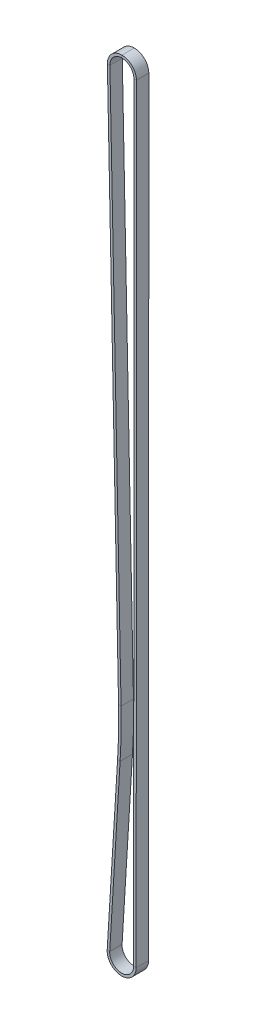
ISO-10303-21;
HEADER;
FILE_DESCRIPTION(('STEP AP214'),'2;1');
FILE_NAME('part.step','',(''),(''),'','','');
FILE_SCHEMA(('AUTOMOTIVE_DESIGN { 1 0 10303 214 1 1 1 1 }'));
ENDSEC;
DATA;
#1=APPLICATION_CONTEXT('core data for automotive mechanical design processes');
#2=APPLICATION_PROTOCOL_DEFINITION('international standard','automotive_design',2000,#1);
#3=PRODUCT_CONTEXT('',#1,'mechanical');
#4=PRODUCT('Part','Part','',(#3));
#5=PRODUCT_RELATED_PRODUCT_CATEGORY('part','',(#4));
#6=PRODUCT_DEFINITION_FORMATION('','',#4);
#7=PRODUCT_DEFINITION_CONTEXT('part definition',#1,'design');
#8=PRODUCT_DEFINITION('design','',#6,#7);
#9=PRODUCT_DEFINITION_SHAPE('','',#8);
#10=(LENGTH_UNIT() NAMED_UNIT(*) SI_UNIT(.MILLI.,.METRE.));
#11=(NAMED_UNIT(*) PLANE_ANGLE_UNIT() SI_UNIT($,.RADIAN.));
#12=(NAMED_UNIT(*) SI_UNIT($,.STERADIAN.) SOLID_ANGLE_UNIT());
#13=UNCERTAINTY_MEASURE_WITH_UNIT(LENGTH_MEASURE(1.E-05),#10,'distance_accuracy_value','');
#14=(GEOMETRIC_REPRESENTATION_CONTEXT(3) GLOBAL_UNCERTAINTY_ASSIGNED_CONTEXT((#13)) GLOBAL_UNIT_ASSIGNED_CONTEXT((#10,
#11,#12)) REPRESENTATION_CONTEXT('',''));
#15=CARTESIAN_POINT('',(0.,0.,0.));
#16=DIRECTION('',(0.,0.,1.));
#17=DIRECTION('',(1.,0.,0.));
#18=AXIS2_PLACEMENT_3D('',#15,#16,#17);
#19=CARTESIAN_POINT('',(0.,0.,0.));
#20=DIRECTION('',(0.,0.,-1.));
#21=DIRECTION('',(-1.,0.,0.));
#22=AXIS2_PLACEMENT_3D('',#19,#20,#21);
#23=CYLINDRICAL_SURFACE('',#22,8.63709969141602);
#24=CARTESIAN_POINT('',(0.,0.,-7.366));
#25=DIRECTION('',(0.,0.,-1.));
#26=DIRECTION('',(-0.999793518372617,-0.0203204483243957,0.));
#27=AXIS2_PLACEMENT_3D('',#24,#25,#26);
#28=CIRCLE('',#27,8.63709969141602);
#29=CARTESIAN_POINT('',(-8.63531628901586,-0.175509737952051,-7.366));
#30=VERTEX_POINT('',#29);
#31=CARTESIAN_POINT('',(0.,8.63709969141602,-7.366));
#32=VERTEX_POINT('',#31);
#33=EDGE_CURVE('E11',#30,#32,#28,.T.);
#34=ORIENTED_EDGE('',*,*,#33,.F.);
#35=DIRECTION('',(0.,0.,1.));
#36=VECTOR('',#35,1.);
#37=CARTESIAN_POINT('',(-8.63531628901586,-0.175509737952078,0.));
#38=LINE('',#37,#36);
#39=CARTESIAN_POINT('',(-8.63531628901586,-0.175509737952051,0.));
#40=VERTEX_POINT('',#39);
#41=EDGE_CURVE('E36',#30,#40,#38,.T.);
#42=ORIENTED_EDGE('',*,*,#41,.T.);
#43=CARTESIAN_POINT('',(0.,0.,0.));
#44=DIRECTION('',(0.,0.,-1.));
#45=DIRECTION('',(-0.999793518372617,-0.0203204483243957,0.));
#46=AXIS2_PLACEMENT_3D('',#43,#44,#45);
#47=CIRCLE('',#46,8.63709969141602);
#48=CARTESIAN_POINT('',(0.,8.63709969141602,0.));
#49=VERTEX_POINT('',#48);
#50=EDGE_CURVE('E157',#40,#49,#47,.T.);
#51=ORIENTED_EDGE('',*,*,#50,.T.);
#52=DIRECTION('',(0.,0.,1.));
#53=VECTOR('',#52,1.);
#54=CARTESIAN_POINT('',(0.,8.63709969141602,0.));
#55=LINE('',#54,#53);
#56=EDGE_CURVE('E160',#32,#49,#55,.T.);
#57=ORIENTED_EDGE('',*,*,#56,.F.);
#58=EDGE_LOOP('',(#34,#42,#51,#57));
#59=FACE_BOUND('',#58,.T.);
#60=ADVANCED_FACE('F33',(#59),#23,.T.);
#61=CARTESIAN_POINT('',(-8.63531628901586,-0.175509737952073,-7.366));
#62=DIRECTION('',(0.,0.,-1.));
#63=DIRECTION('',(-1.,0.,0.));
#64=AXIS2_PLACEMENT_3D('',#61,#62,#63);
#65=PLANE('',#64);
#66=CARTESIAN_POINT('',(0.,0.,-7.366));
#67=DIRECTION('',(0.,0.,-1.));
#68=DIRECTION('',(-0.999793518372617,-0.0203204483243957,0.));
#69=AXIS2_PLACEMENT_3D('',#66,#67,#68);
#70=CIRCLE('',#69,7.13709969141602);
#71=CARTESIAN_POINT('',(-7.13562601145693,-0.145029065465485,-7.366));
#72=VERTEX_POINT('',#71);
#73=CARTESIAN_POINT('',(0.,7.13709969141602,-7.366));
#74=VERTEX_POINT('',#73);
#75=EDGE_CURVE('E41',#72,#74,#70,.T.);
#76=ORIENTED_EDGE('',*,*,#75,.F.);
#77=DIRECTION('',(-0.999793518372617,-0.0203204483243962,0.));
#78=VECTOR('',#77,1.);
#79=CARTESIAN_POINT('',(-8.63531628901586,-0.175509737952078,-7.366));
#80=LINE('',#79,#78);
#81=EDGE_CURVE('E276',#72,#30,#80,.T.);
#82=ORIENTED_EDGE('',*,*,#81,.T.);
#83=ORIENTED_EDGE('',*,*,#33,.T.);
#84=DIRECTION('',(0.,1.,0.));
#85=VECTOR('',#84,1.);
#86=CARTESIAN_POINT('',(0.,8.63709969141602,-7.366));
#87=LINE('',#86,#85);
#88=EDGE_CURVE('E185',#74,#32,#87,.T.);
#89=ORIENTED_EDGE('',*,*,#88,.F.);
#90=EDGE_LOOP('',(#76,#82,#83,#89));
#91=FACE_BOUND('',#90,.T.);
#92=ADVANCED_FACE('F371',(#91),#65,.T.);
#93=CARTESIAN_POINT('',(0.,0.,0.));
#94=DIRECTION('',(0.,0.,-1.));
#95=DIRECTION('',(-1.,0.,0.));
#96=AXIS2_PLACEMENT_3D('',#93,#94,#95);
#97=CYLINDRICAL_SURFACE('',#96,7.13709969141602);
#98=CARTESIAN_POINT('',(0.,0.,0.));
#99=DIRECTION('',(0.,0.,-1.));
#100=DIRECTION('',(-0.999793518372617,-0.0203204483243957,0.));
#101=AXIS2_PLACEMENT_3D('',#98,#99,#100);
#102=CIRCLE('',#101,7.13709969141602);
#103=CARTESIAN_POINT('',(-7.13562601145693,-0.145029065465485,0.));
#104=VERTEX_POINT('',#103);
#105=CARTESIAN_POINT('',(0.,7.13709969141602,0.));
#106=VERTEX_POINT('',#105);
#107=EDGE_CURVE('E166',#104,#106,#102,.T.);
#108=ORIENTED_EDGE('',*,*,#107,.F.);
#109=DIRECTION('',(0.,0.,-1.));
#110=VECTOR('',#109,1.);
#111=CARTESIAN_POINT('',(-7.13562601145694,-0.145029065465483,0.));
#112=LINE('',#111,#110);
#113=EDGE_CURVE('E244',#104,#72,#112,.T.);
#114=ORIENTED_EDGE('',*,*,#113,.T.);
#115=ORIENTED_EDGE('',*,*,#75,.T.);
#116=DIRECTION('',(0.,0.,-1.));
#117=VECTOR('',#116,1.);
#118=CARTESIAN_POINT('',(0.,7.13709969141602,0.));
#119=LINE('',#118,#117);
#120=EDGE_CURVE('E189',#106,#74,#119,.T.);
#121=ORIENTED_EDGE('',*,*,#120,.F.);
#122=EDGE_LOOP('',(#108,#114,#115,#121));
#123=FACE_BOUND('',#122,.T.);
#124=ADVANCED_FACE('F375',(#123),#97,.F.);
#125=CARTESIAN_POINT('',(-1.99270222755832,-327.001098311344,0.));
#126=DIRECTION('',(-0.999793518372617,-0.0203204483243964,0.));
#127=DIRECTION('',(0.0203204483243964,-0.999793518372617,0.));
#128=AXIS2_PLACEMENT_3D('',#125,#126,#127);
#129=PLANE('',#128);
#130=ORIENTED_EDGE('',*,*,#41,.F.);
#131=DIRECTION('',(-0.0203204483243964,0.999793518372617,0.));
#132=VECTOR('',#131,1.);
#133=CARTESIAN_POINT('',(-1.99270222755832,-327.001098311344,-7.366));
#134=LINE('',#133,#132);
#135=CARTESIAN_POINT('',(-1.99270222755832,-327.001098311344,-7.366));
#136=VERTEX_POINT('',#135);
#137=EDGE_CURVE('E92',#136,#30,#134,.T.);
#138=ORIENTED_EDGE('',*,*,#137,.F.);
#139=DIRECTION('',(0.,0.,1.));
#140=VECTOR('',#139,1.);
#141=CARTESIAN_POINT('',(-1.99270222755832,-327.001098311344,0.));
#142=LINE('',#141,#140);
#143=CARTESIAN_POINT('',(-1.99270222755832,-327.001098311344,0.));
#144=VERTEX_POINT('',#143);
#145=EDGE_CURVE('E247',#136,#144,#142,.T.);
#146=ORIENTED_EDGE('',*,*,#145,.T.);
#147=DIRECTION('',(-0.0203204483243964,0.999793518372617,0.));
#148=VECTOR('',#147,1.);
#149=CARTESIAN_POINT('',(-1.99270222755832,-327.001098311344,0.));
#150=LINE('',#149,#148);
#151=EDGE_CURVE('E242',#144,#40,#150,.T.);
#152=ORIENTED_EDGE('',*,*,#151,.T.);
#153=EDGE_LOOP('',(#130,#138,#146,#152));
#154=FACE_BOUND('',#153,.T.);
#155=ADVANCED_FACE('F308',(#154),#129,.T.);
#156=CARTESIAN_POINT('',(-1.99270222755832,-327.001098311344,-7.366));
#157=DIRECTION('',(0.,0.,-1.));
#158=DIRECTION('',(-1.,0.,0.));
#159=AXIS2_PLACEMENT_3D('',#156,#157,#158);
#160=PLANE('',#159);
#161=ORIENTED_EDGE('',*,*,#137,.T.);
#162=ORIENTED_EDGE('',*,*,#81,.F.);
#163=DIRECTION('',(-0.0203204483243964,0.999793518372617,0.));
#164=VECTOR('',#163,1.);
#165=CARTESIAN_POINT('',(-0.493011949999391,-326.970617638858,-7.366));
#166=LINE('',#165,#164);
#167=CARTESIAN_POINT('',(-0.493011949999456,-326.970617638858,-7.366));
#168=VERTEX_POINT('',#167);
#169=EDGE_CURVE('E101',#168,#72,#166,.T.);
#170=ORIENTED_EDGE('',*,*,#169,.F.);
#171=DIRECTION('',(-0.999793518372617,-0.0203204483243959,0.));
#172=VECTOR('',#171,1.);
#173=CARTESIAN_POINT('',(-1.99270222755832,-327.001098311344,-7.366));
#174=LINE('',#173,#172);
#175=EDGE_CURVE('E272',#168,#136,#174,.T.);
#176=ORIENTED_EDGE('',*,*,#175,.T.);
#177=EDGE_LOOP('',(#161,#162,#170,#176));
#178=FACE_BOUND('',#177,.T.);
#179=ADVANCED_FACE('F383',(#178),#160,.T.);
#180=CARTESIAN_POINT('',(-0.493011949999391,-326.970617638858,0.));
#181=DIRECTION('',(0.999793518372617,0.0203204483243964,0.));
#182=DIRECTION('',(-0.0203204483243964,0.999793518372617,0.));
#183=AXIS2_PLACEMENT_3D('',#180,#181,#182);
#184=PLANE('',#183);
#185=ORIENTED_EDGE('',*,*,#169,.T.);
#186=ORIENTED_EDGE('',*,*,#113,.F.);
#187=DIRECTION('',(-0.0203204483243964,0.999793518372617,0.));
#188=VECTOR('',#187,1.);
#189=CARTESIAN_POINT('',(-0.493011949999391,-326.970617638858,0.));
#190=LINE('',#189,#188);
#191=CARTESIAN_POINT('',(-0.493011949999456,-326.970617638858,0.));
#192=VERTEX_POINT('',#191);
#193=EDGE_CURVE('E109',#192,#104,#190,.T.);
#194=ORIENTED_EDGE('',*,*,#193,.F.);
#195=DIRECTION('',(0.,0.,-1.));
#196=VECTOR('',#195,1.);
#197=CARTESIAN_POINT('',(-0.493011949999391,-326.970617638858,0.));
#198=LINE('',#197,#196);
#199=EDGE_CURVE('E236',#192,#168,#198,.T.);
#200=ORIENTED_EDGE('',*,*,#199,.T.);
#201=EDGE_LOOP('',(#185,#186,#194,#200));
#202=FACE_BOUND('',#201,.T.);
#203=ADVANCED_FACE('F399',(#202),#184,.T.);
#204=CARTESIAN_POINT('',(-1.99270222755832,-327.001098311344,0.));
#205=DIRECTION('',(0.,0.,1.));
#206=DIRECTION('',(1.,0.,0.));
#207=AXIS2_PLACEMENT_3D('',#204,#205,#206);
#208=PLANE('',#207);
#209=ORIENTED_EDGE('',*,*,#193,.T.);
#210=DIRECTION('',(0.999793518372617,0.0203204483243962,0.));
#211=VECTOR('',#210,1.);
#212=CARTESIAN_POINT('',(-8.63531628901586,-0.175509737952078,0.));
#213=LINE('',#212,#211);
#214=EDGE_CURVE('E240',#40,#104,#213,.T.);
#215=ORIENTED_EDGE('',*,*,#214,.F.);
#216=ORIENTED_EDGE('',*,*,#151,.F.);
#217=DIRECTION('',(0.999793518372617,0.0203204483243959,0.));
#218=VECTOR('',#217,1.);
#219=CARTESIAN_POINT('',(-1.99270222755832,-327.001098311344,0.));
#220=LINE('',#219,#218);
#221=EDGE_CURVE('E231',#144,#192,#220,.T.);
#222=ORIENTED_EDGE('',*,*,#221,.T.);
#223=EDGE_LOOP('',(#209,#215,#216,#222));
#224=FACE_BOUND('',#223,.T.);
#225=ADVANCED_FACE('F394',(#224),#208,.T.);
#226=CARTESIAN_POINT('',(-353.813499999999,-334.151731126228,0.));
#227=DIRECTION('',(0.,0.,1.));
#228=DIRECTION('',(1.,0.,0.));
#229=AXIS2_PLACEMENT_3D('',#226,#227,#228);
#230=CYLINDRICAL_SURFACE('',#229,351.893457306171);
#231=ORIENTED_EDGE('',*,*,#145,.F.);
#232=CARTESIAN_POINT('',(-353.813499999999,-334.151731126228,-7.366));
#233=DIRECTION('',(0.,0.,1.));
#234=DIRECTION('',(0.998139717767645,-0.0609680556908802,0.));
#235=AXIS2_PLACEMENT_3D('',#232,#233,#234);
#236=CIRCLE('',#235,351.893457306171);
#237=CARTESIAN_POINT('',(-2.57466384013685,-355.605991028527,-7.366));
#238=VERTEX_POINT('',#237);
#239=EDGE_CURVE('E295',#238,#136,#236,.T.);
#240=ORIENTED_EDGE('',*,*,#239,.F.);
#241=DIRECTION('',(0.,0.,1.));
#242=VECTOR('',#241,1.);
#243=CARTESIAN_POINT('',(-2.57466384013685,-355.605991028527,0.));
#244=LINE('',#243,#242);
#245=CARTESIAN_POINT('',(-2.57466384013685,-355.605991028527,0.));
#246=VERTEX_POINT('',#245);
#247=EDGE_CURVE('E239',#238,#246,#244,.T.);
#248=ORIENTED_EDGE('',*,*,#247,.T.);
#249=CARTESIAN_POINT('',(-353.813499999999,-334.151731126228,0.));
#250=DIRECTION('',(0.,0.,1.));
#251=DIRECTION('',(0.998139717767645,-0.0609680556908802,0.));
#252=AXIS2_PLACEMENT_3D('',#249,#250,#251);
#253=CIRCLE('',#252,351.893457306171);
#254=EDGE_CURVE('E234',#246,#144,#253,.T.);
#255=ORIENTED_EDGE('',*,*,#254,.T.);
#256=EDGE_LOOP('',(#231,#240,#248,#255));
#257=FACE_BOUND('',#256,.T.);
#258=ADVANCED_FACE('F313',(#257),#230,.F.);
#259=CARTESIAN_POINT('',(-2.57466384013686,-355.605991028527,-7.366));
#260=DIRECTION('',(0.,0.,-1.));
#261=DIRECTION('',(-1.,0.,0.));
#262=AXIS2_PLACEMENT_3D('',#259,#260,#261);
#263=PLANE('',#262);
#264=ORIENTED_EDGE('',*,*,#239,.T.);
#265=ORIENTED_EDGE('',*,*,#175,.F.);
#266=CARTESIAN_POINT('',(-353.813499999999,-334.151731126228,-7.366));
#267=DIRECTION('',(0.,0.,1.));
#268=DIRECTION('',(0.998139717767645,-0.0609680556908802,0.));
#269=AXIS2_PLACEMENT_3D('',#266,#267,#268);
#270=CIRCLE('',#269,353.393457306171);
#271=CARTESIAN_POINT('',(-1.07745426348538,-355.697443112063,-7.366));
#272=VERTEX_POINT('',#271);
#273=EDGE_CURVE('E130',#272,#168,#270,.T.);
#274=ORIENTED_EDGE('',*,*,#273,.F.);
#275=DIRECTION('',(-0.998139717767645,0.0609680556908806,0.));
#276=VECTOR('',#275,1.);
#277=CARTESIAN_POINT('',(-2.57466384013685,-355.605991028527,-7.366));
#278=LINE('',#277,#276);
#279=EDGE_CURVE('E269',#272,#238,#278,.T.);
#280=ORIENTED_EDGE('',*,*,#279,.T.);
#281=EDGE_LOOP('',(#264,#265,#274,#280));
#282=FACE_BOUND('',#281,.T.);
#283=ADVANCED_FACE('F393',(#282),#263,.T.);
#284=CARTESIAN_POINT('',(-353.813499999999,-334.151731126228,0.));
#285=DIRECTION('',(0.,0.,1.));
#286=DIRECTION('',(1.,0.,0.));
#287=AXIS2_PLACEMENT_3D('',#284,#285,#286);
#288=CYLINDRICAL_SURFACE('',#287,353.393457306171);
#289=ORIENTED_EDGE('',*,*,#273,.T.);
#290=ORIENTED_EDGE('',*,*,#199,.F.);
#291=CARTESIAN_POINT('',(-353.813499999999,-334.151731126228,0.));
#292=DIRECTION('',(0.,0.,1.));
#293=DIRECTION('',(0.998139717767645,-0.0609680556908802,0.));
#294=AXIS2_PLACEMENT_3D('',#291,#292,#293);
#295=CIRCLE('',#294,353.393457306171);
#296=CARTESIAN_POINT('',(-1.07745426348538,-355.697443112063,0.));
#297=VERTEX_POINT('',#296);
#298=EDGE_CURVE('E136',#297,#192,#295,.T.);
#299=ORIENTED_EDGE('',*,*,#298,.F.);
#300=DIRECTION('',(0.,0.,-1.));
#301=VECTOR('',#300,1.);
#302=CARTESIAN_POINT('',(-1.07745426348538,-355.697443112063,0.));
#303=LINE('',#302,#301);
#304=EDGE_CURVE('E227',#297,#272,#303,.T.);
#305=ORIENTED_EDGE('',*,*,#304,.T.);
#306=EDGE_LOOP('',(#289,#290,#299,#305));
#307=FACE_BOUND('',#306,.T.);
#308=ADVANCED_FACE('F404',(#307),#288,.T.);
#309=CARTESIAN_POINT('',(-2.57466384013686,-355.605991028527,0.));
#310=DIRECTION('',(0.,0.,1.));
#311=DIRECTION('',(1.,0.,0.));
#312=AXIS2_PLACEMENT_3D('',#309,#310,#311);
#313=PLANE('',#312);
#314=ORIENTED_EDGE('',*,*,#298,.T.);
#315=ORIENTED_EDGE('',*,*,#221,.F.);
#316=ORIENTED_EDGE('',*,*,#254,.F.);
#317=DIRECTION('',(0.998139717767645,-0.0609680556908806,0.));
#318=VECTOR('',#317,1.);
#319=CARTESIAN_POINT('',(-2.57466384013685,-355.605991028527,0.));
#320=LINE('',#319,#318);
#321=EDGE_CURVE('E220',#246,#297,#320,.T.);
#322=ORIENTED_EDGE('',*,*,#321,.T.);
#323=EDGE_LOOP('',(#314,#315,#316,#322));
#324=FACE_BOUND('',#323,.T.);
#325=ADVANCED_FACE('F311',(#324),#313,.T.);
#326=CARTESIAN_POINT('',(-8.74803224832181,-456.673412825006,0.));
#327=DIRECTION('',(-0.998139717767645,0.0609680556908804,0.));
#328=DIRECTION('',(-0.0609680556908804,-0.998139717767645,0.));
#329=AXIS2_PLACEMENT_3D('',#326,#327,#328);
#330=PLANE('',#329);
#331=ORIENTED_EDGE('',*,*,#247,.F.);
#332=DIRECTION('',(0.0609680556908804,0.998139717767645,0.));
#333=VECTOR('',#332,1.);
#334=CARTESIAN_POINT('',(-8.74803224832181,-456.673412825006,-7.366));
#335=LINE('',#334,#333);
#336=CARTESIAN_POINT('',(-8.74803224832181,-456.673412825006,-7.366));
#337=VERTEX_POINT('',#336);
#338=EDGE_CURVE('E291',#337,#238,#335,.T.);
#339=ORIENTED_EDGE('',*,*,#338,.F.);
#340=DIRECTION('',(0.,0.,1.));
#341=VECTOR('',#340,1.);
#342=CARTESIAN_POINT('',(-8.74803224832182,-456.673412825006,0.));
#343=LINE('',#342,#341);
#344=CARTESIAN_POINT('',(-8.74803224832181,-456.673412825006,0.));
#345=VERTEX_POINT('',#344);
#346=EDGE_CURVE('E230',#337,#345,#343,.T.);
#347=ORIENTED_EDGE('',*,*,#346,.T.);
#348=DIRECTION('',(0.0609680556908804,0.998139717767645,0.));
#349=VECTOR('',#348,1.);
#350=CARTESIAN_POINT('',(-8.74803224832181,-456.673412825006,0.));
#351=LINE('',#350,#349);
#352=EDGE_CURVE('E224',#345,#246,#351,.T.);
#353=ORIENTED_EDGE('',*,*,#352,.T.);
#354=EDGE_LOOP('',(#331,#339,#347,#353));
#355=FACE_BOUND('',#354,.T.);
#356=ADVANCED_FACE('F322',(#355),#330,.T.);
#357=CARTESIAN_POINT('',(-8.74803224832181,-456.673412825006,-7.366));
#358=DIRECTION('',(0.,0.,-1.));
#359=DIRECTION('',(-1.,0.,0.));
#360=AXIS2_PLACEMENT_3D('',#357,#358,#359);
#361=PLANE('',#360);
#362=ORIENTED_EDGE('',*,*,#338,.T.);
#363=ORIENTED_EDGE('',*,*,#279,.F.);
#364=DIRECTION('',(0.0609680556908804,0.998139717767645,0.));
#365=VECTOR('',#364,1.);
#366=CARTESIAN_POINT('',(-7.25082267167035,-456.764864908542,-7.366));
#367=LINE('',#366,#365);
#368=CARTESIAN_POINT('',(-7.25082267167034,-456.764864908542,-7.366));
#369=VERTEX_POINT('',#368);
#370=EDGE_CURVE('E266',#369,#272,#367,.T.);
#371=ORIENTED_EDGE('',*,*,#370,.F.);
#372=DIRECTION('',(-0.998139717767645,0.0609680556908823,0.));
#373=VECTOR('',#372,1.);
#374=CARTESIAN_POINT('',(-8.74803224832182,-456.673412825006,-7.366));
#375=LINE('',#374,#373);
#376=EDGE_CURVE('E263',#369,#337,#375,.T.);
#377=ORIENTED_EDGE('',*,*,#376,.T.);
#378=EDGE_LOOP('',(#362,#363,#371,#377));
#379=FACE_BOUND('',#378,.T.);
#380=ADVANCED_FACE('F340',(#379),#361,.T.);
#381=CARTESIAN_POINT('',(-7.25082267167035,-456.764864908542,0.));
#382=DIRECTION('',(0.998139717767645,-0.0609680556908804,0.));
#383=DIRECTION('',(0.0609680556908804,0.998139717767645,0.));
#384=AXIS2_PLACEMENT_3D('',#381,#382,#383);
#385=PLANE('',#384);
#386=ORIENTED_EDGE('',*,*,#370,.T.);
#387=ORIENTED_EDGE('',*,*,#304,.F.);
#388=DIRECTION('',(0.0609680556908804,0.998139717767645,0.));
#389=VECTOR('',#388,1.);
#390=CARTESIAN_POINT('',(-7.25082267167035,-456.764864908542,0.));
#391=LINE('',#390,#389);
#392=CARTESIAN_POINT('',(-7.25082267167034,-456.764864908542,0.));
#393=VERTEX_POINT('',#392);
#394=EDGE_CURVE('E223',#393,#297,#391,.T.);
#395=ORIENTED_EDGE('',*,*,#394,.F.);
#396=DIRECTION('',(0.,0.,-1.));
#397=VECTOR('',#396,1.);
#398=CARTESIAN_POINT('',(-7.25082267167035,-456.764864908542,0.));
#399=LINE('',#398,#397);
#400=EDGE_CURVE('E212',#393,#369,#399,.T.);
#401=ORIENTED_EDGE('',*,*,#400,.T.);
#402=EDGE_LOOP('',(#386,#387,#395,#401));
#403=FACE_BOUND('',#402,.T.);
#404=ADVANCED_FACE('F333',(#403),#385,.T.);
#405=CARTESIAN_POINT('',(-8.74803224832181,-456.673412825006,0.));
#406=DIRECTION('',(0.,0.,1.));
#407=DIRECTION('',(1.,0.,0.));
#408=AXIS2_PLACEMENT_3D('',#405,#406,#407);
#409=PLANE('',#408);
#410=ORIENTED_EDGE('',*,*,#394,.T.);
#411=ORIENTED_EDGE('',*,*,#321,.F.);
#412=ORIENTED_EDGE('',*,*,#352,.F.);
#413=DIRECTION('',(0.998139717767645,-0.0609680556908823,0.));
#414=VECTOR('',#413,1.);
#415=CARTESIAN_POINT('',(-8.74803224832182,-456.673412825006,0.));
#416=LINE('',#415,#414);
#417=EDGE_CURVE('E209',#345,#393,#416,.T.);
#418=ORIENTED_EDGE('',*,*,#417,.T.);
#419=EDGE_LOOP('',(#410,#411,#412,#418));
#420=FACE_BOUND('',#419,.T.);
#421=ADVANCED_FACE('F320',(#420),#409,.T.);
#422=CARTESIAN_POINT('',(-0.127000000000821,-457.199999999999,0.));
#423=DIRECTION('',(0.,0.,-1.));
#424=DIRECTION('',(-1.,0.,0.));
#425=AXIS2_PLACEMENT_3D('',#422,#423,#424);
#426=CYLINDRICAL_SURFACE('',#425,8.63709969141602);
#427=ORIENTED_EDGE('',*,*,#346,.F.);
#428=CARTESIAN_POINT('',(-0.127000000000821,-457.199999999999,-7.366));
#429=DIRECTION('',(0.,0.,-1.));
#430=DIRECTION('',(0.999999961419755,-0.000277777767058707,0.));
#431=AXIS2_PLACEMENT_3D('',#428,#429,#430);
#432=CIRCLE('',#431,8.63709969141602);
#433=CARTESIAN_POINT('',(8.51009935819378,-457.202399194266,-7.366));
#434=VERTEX_POINT('',#433);
#435=EDGE_CURVE('E213',#434,#337,#432,.T.);
#436=ORIENTED_EDGE('',*,*,#435,.F.);
#437=DIRECTION('',(0.,0.,1.));
#438=VECTOR('',#437,1.);
#439=CARTESIAN_POINT('',(8.51009935819378,-457.202399194266,0.));
#440=LINE('',#439,#438);
#441=CARTESIAN_POINT('',(8.51009935819378,-457.202399194266,0.));
#442=VERTEX_POINT('',#441);
#443=EDGE_CURVE('E219',#434,#442,#440,.T.);
#444=ORIENTED_EDGE('',*,*,#443,.T.);
#445=CARTESIAN_POINT('',(-0.127000000000821,-457.199999999999,0.));
#446=DIRECTION('',(0.,0.,-1.));
#447=DIRECTION('',(0.999999961419755,-0.000277777767058707,0.));
#448=AXIS2_PLACEMENT_3D('',#445,#446,#447);
#449=CIRCLE('',#448,8.63709969141602);
#450=EDGE_CURVE('E217',#442,#345,#449,.T.);
#451=ORIENTED_EDGE('',*,*,#450,.T.);
#452=EDGE_LOOP('',(#427,#436,#444,#451));
#453=FACE_BOUND('',#452,.T.);
#454=ADVANCED_FACE('F343',(#453),#426,.T.);
#455=CARTESIAN_POINT('',(8.51009935819378,-457.202399194266,-7.366));
#456=DIRECTION('',(0.,0.,-1.));
#457=DIRECTION('',(-1.,0.,0.));
#458=AXIS2_PLACEMENT_3D('',#455,#456,#457);
#459=PLANE('',#458);
#460=ORIENTED_EDGE('',*,*,#435,.T.);
#461=ORIENTED_EDGE('',*,*,#376,.F.);
#462=CARTESIAN_POINT('',(-0.127000000000821,-457.199999999999,-7.366));
#463=DIRECTION('',(0.,0.,-1.));
#464=DIRECTION('',(0.999999961419755,-0.000277777767061075,0.));
#465=AXIS2_PLACEMENT_3D('',#462,#463,#464);
#466=CIRCLE('',#465,7.13709969141602);
#467=CARTESIAN_POINT('',(7.01009941606414,-457.201982527615,-7.366));
#468=VERTEX_POINT('',#467);
#469=EDGE_CURVE('E216',#468,#369,#466,.T.);
#470=ORIENTED_EDGE('',*,*,#469,.F.);
#471=DIRECTION('',(0.999999961419755,-0.000277777767063023,0.));
#472=VECTOR('',#471,1.);
#473=CARTESIAN_POINT('',(8.51009935819378,-457.202399194266,-7.366));
#474=LINE('',#473,#472);
#475=EDGE_CURVE('E260',#468,#434,#474,.T.);
#476=ORIENTED_EDGE('',*,*,#475,.T.);
#477=EDGE_LOOP('',(#460,#461,#470,#476));
#478=FACE_BOUND('',#477,.T.);
#479=ADVANCED_FACE('F341',(#478),#459,.T.);
#480=CARTESIAN_POINT('',(-0.127000000000821,-457.199999999999,0.));
#481=DIRECTION('',(0.,0.,-1.));
#482=DIRECTION('',(-1.,0.,0.));
#483=AXIS2_PLACEMENT_3D('',#480,#481,#482);
#484=CYLINDRICAL_SURFACE('',#483,7.13709969141602);
#485=ORIENTED_EDGE('',*,*,#469,.T.);
#486=ORIENTED_EDGE('',*,*,#400,.F.);
#487=CARTESIAN_POINT('',(-0.127000000000821,-457.199999999999,0.));
#488=DIRECTION('',(0.,0.,-1.));
#489=DIRECTION('',(0.999999961419755,-0.000277777767061075,0.));
#490=AXIS2_PLACEMENT_3D('',#487,#488,#489);
#491=CIRCLE('',#490,7.13709969141602);
#492=CARTESIAN_POINT('',(7.01009941606414,-457.201982527615,0.));
#493=VERTEX_POINT('',#492);
#494=EDGE_CURVE('E214',#493,#393,#491,.T.);
#495=ORIENTED_EDGE('',*,*,#494,.F.);
#496=DIRECTION('',(0.,0.,-1.));
#497=VECTOR('',#496,1.);
#498=CARTESIAN_POINT('',(7.01009941606414,-457.201982527615,0.));
#499=LINE('',#498,#497);
#500=EDGE_CURVE('E205',#493,#468,#499,.T.);
#501=ORIENTED_EDGE('',*,*,#500,.T.);
#502=EDGE_LOOP('',(#485,#486,#495,#501));
#503=FACE_BOUND('',#502,.T.);
#504=ADVANCED_FACE('F334',(#503),#484,.F.);
#505=CARTESIAN_POINT('',(8.51009935819378,-457.202399194266,0.));
#506=DIRECTION('',(0.,0.,1.));
#507=DIRECTION('',(1.,0.,0.));
#508=AXIS2_PLACEMENT_3D('',#505,#506,#507);
#509=PLANE('',#508);
#510=ORIENTED_EDGE('',*,*,#494,.T.);
#511=ORIENTED_EDGE('',*,*,#417,.F.);
#512=ORIENTED_EDGE('',*,*,#450,.F.);
#513=DIRECTION('',(-0.999999961419755,0.000277777767063023,0.));
#514=VECTOR('',#513,1.);
#515=CARTESIAN_POINT('',(8.51009935819378,-457.202399194266,0.));
#516=LINE('',#515,#514);
#517=EDGE_CURVE('E198',#442,#493,#516,.T.);
#518=ORIENTED_EDGE('',*,*,#517,.T.);
#519=EDGE_LOOP('',(#510,#511,#512,#518));
#520=FACE_BOUND('',#519,.T.);
#521=ADVANCED_FACE('F327',(#520),#509,.T.);
#522=CARTESIAN_POINT('',(8.6370993581946,-0.00239919426618226,0.));
#523=DIRECTION('',(0.999999961419755,-0.000277777767062839,0.));
#524=DIRECTION('',(0.000277777767062839,0.999999961419755,0.));
#525=AXIS2_PLACEMENT_3D('',#522,#523,#524);
#526=PLANE('',#525);
#527=ORIENTED_EDGE('',*,*,#443,.F.);
#528=DIRECTION('',(-0.000277777767062839,-0.999999961419755,0.));
#529=VECTOR('',#528,1.);
#530=CARTESIAN_POINT('',(8.6370993581946,-0.00239919426618226,-7.366));
#531=LINE('',#530,#529);
#532=CARTESIAN_POINT('',(8.6370993581946,-0.00239919426630486,-7.366));
#533=VERTEX_POINT('',#532);
#534=EDGE_CURVE('E284',#533,#434,#531,.T.);
#535=ORIENTED_EDGE('',*,*,#534,.F.);
#536=DIRECTION('',(0.,0.,1.));
#537=VECTOR('',#536,1.);
#538=CARTESIAN_POINT('',(8.6370993581946,-0.00239919426630506,0.));
#539=LINE('',#538,#537);
#540=CARTESIAN_POINT('',(8.6370993581946,-0.00239919426630486,0.));
#541=VERTEX_POINT('',#540);
#542=EDGE_CURVE('E208',#533,#541,#539,.T.);
#543=ORIENTED_EDGE('',*,*,#542,.T.);
#544=DIRECTION('',(-0.000277777767062839,-0.999999961419755,0.));
#545=VECTOR('',#544,1.);
#546=CARTESIAN_POINT('',(8.6370993581946,-0.00239919426618226,0.));
#547=LINE('',#546,#545);
#548=EDGE_CURVE('E202',#541,#442,#547,.T.);
#549=ORIENTED_EDGE('',*,*,#548,.T.);
#550=EDGE_LOOP('',(#527,#535,#543,#549));
#551=FACE_BOUND('',#550,.T.);
#552=ADVANCED_FACE('F345',(#551),#526,.T.);
#553=CARTESIAN_POINT('',(8.6370993581946,-0.00239919426618226,-7.366));
#554=DIRECTION('',(0.,0.,-1.));
#555=DIRECTION('',(-1.,0.,0.));
#556=AXIS2_PLACEMENT_3D('',#553,#554,#555);
#557=PLANE('',#556);
#558=ORIENTED_EDGE('',*,*,#534,.T.);
#559=ORIENTED_EDGE('',*,*,#475,.F.);
#560=DIRECTION('',(-0.000277777767062839,-0.999999961419755,0.));
#561=VECTOR('',#560,1.);
#562=CARTESIAN_POINT('',(7.13709941606496,-0.00198252761558773,-7.366));
#563=LINE('',#562,#561);
#564=CARTESIAN_POINT('',(7.13709941606496,-0.00198252761568904,-7.366));
#565=VERTEX_POINT('',#564);
#566=EDGE_CURVE('E257',#565,#468,#563,.T.);
#567=ORIENTED_EDGE('',*,*,#566,.F.);
#568=DIRECTION('',(0.999999961419755,-0.00027777776707724,0.));
#569=VECTOR('',#568,1.);
#570=CARTESIAN_POINT('',(8.6370993581946,-0.00239919426630506,-7.366));
#571=LINE('',#570,#569);
#572=EDGE_CURVE('E254',#565,#533,#571,.T.);
#573=ORIENTED_EDGE('',*,*,#572,.T.);
#574=EDGE_LOOP('',(#558,#559,#567,#573));
#575=FACE_BOUND('',#574,.T.);
#576=ADVANCED_FACE('F347',(#575),#557,.T.);
#577=CARTESIAN_POINT('',(7.13709941606496,-0.00198252761558773,0.));
#578=DIRECTION('',(-0.999999961419755,0.000277777767062839,0.));
#579=DIRECTION('',(-0.000277777767062839,-0.999999961419755,0.));
#580=AXIS2_PLACEMENT_3D('',#577,#578,#579);
#581=PLANE('',#580);
#582=ORIENTED_EDGE('',*,*,#566,.T.);
#583=ORIENTED_EDGE('',*,*,#500,.F.);
#584=DIRECTION('',(-0.000277777767062839,-0.999999961419755,0.));
#585=VECTOR('',#584,1.);
#586=CARTESIAN_POINT('',(7.13709941606496,-0.00198252761558773,0.));
#587=LINE('',#586,#585);
#588=CARTESIAN_POINT('',(7.13709941606496,-0.00198252761568904,0.));
#589=VERTEX_POINT('',#588);
#590=EDGE_CURVE('E201',#589,#493,#587,.T.);
#591=ORIENTED_EDGE('',*,*,#590,.F.);
#592=DIRECTION('',(0.,0.,-1.));
#593=VECTOR('',#592,1.);
#594=CARTESIAN_POINT('',(7.13709941606496,-0.0019825276156892,0.));
#595=LINE('',#594,#593);
#596=EDGE_CURVE('E196',#589,#565,#595,.T.);
#597=ORIENTED_EDGE('',*,*,#596,.T.);
#598=EDGE_LOOP('',(#582,#583,#591,#597));
#599=FACE_BOUND('',#598,.T.);
#600=ADVANCED_FACE('F357',(#599),#581,.T.);
#601=CARTESIAN_POINT('',(8.6370993581946,-0.00239919426618226,0.));
#602=DIRECTION('',(0.,0.,1.));
#603=DIRECTION('',(1.,0.,0.));
#604=AXIS2_PLACEMENT_3D('',#601,#602,#603);
#605=PLANE('',#604);
#606=ORIENTED_EDGE('',*,*,#590,.T.);
#607=ORIENTED_EDGE('',*,*,#517,.F.);
#608=ORIENTED_EDGE('',*,*,#548,.F.);
#609=DIRECTION('',(-0.999999961419755,0.00027777776707724,0.));
#610=VECTOR('',#609,1.);
#611=CARTESIAN_POINT('',(8.6370993581946,-0.00239919426630506,0.));
#612=LINE('',#611,#610);
#613=EDGE_CURVE('E177',#541,#589,#612,.T.);
#614=ORIENTED_EDGE('',*,*,#613,.T.);
#615=EDGE_LOOP('',(#606,#607,#608,#614));
#616=FACE_BOUND('',#615,.T.);
#617=ADVANCED_FACE('F359',(#616),#605,.T.);
#618=CARTESIAN_POINT('',(0.,0.,0.));
#619=DIRECTION('',(0.,0.,-1.));
#620=DIRECTION('',(-1.,0.,0.));
#621=AXIS2_PLACEMENT_3D('',#618,#619,#620);
#622=CYLINDRICAL_SURFACE('',#621,8.63709969141602);
#623=ORIENTED_EDGE('',*,*,#542,.F.);
#624=CARTESIAN_POINT('',(0.,0.,-7.366));
#625=DIRECTION('',(0.,0.,-1.));
#626=DIRECTION('',(0.,1.,0.));
#627=AXIS2_PLACEMENT_3D('',#624,#625,#626);
#628=CIRCLE('',#627,8.63709969141602);
#629=EDGE_CURVE('E184',#32,#533,#628,.T.);
#630=ORIENTED_EDGE('',*,*,#629,.F.);
#631=ORIENTED_EDGE('',*,*,#56,.T.);
#632=CARTESIAN_POINT('',(0.,0.,0.));
#633=DIRECTION('',(0.,0.,-1.));
#634=DIRECTION('',(0.,1.,0.));
#635=AXIS2_PLACEMENT_3D('',#632,#633,#634);
#636=CIRCLE('',#635,8.63709969141602);
#637=EDGE_CURVE('E172',#49,#541,#636,.T.);
#638=ORIENTED_EDGE('',*,*,#637,.T.);
#639=EDGE_LOOP('',(#623,#630,#631,#638));
#640=FACE_BOUND('',#639,.T.);
#641=ADVANCED_FACE('F182',(#640),#622,.T.);
#642=CARTESIAN_POINT('',(0.,8.63709969141602,-7.366));
#643=DIRECTION('',(0.,0.,-1.));
#644=DIRECTION('',(-1.,0.,0.));
#645=AXIS2_PLACEMENT_3D('',#642,#643,#644);
#646=PLANE('',#645);
#647=ORIENTED_EDGE('',*,*,#629,.T.);
#648=ORIENTED_EDGE('',*,*,#572,.F.);
#649=CARTESIAN_POINT('',(0.,0.,-7.366));
#650=DIRECTION('',(0.,0.,-1.));
#651=DIRECTION('',(0.,1.,0.));
#652=AXIS2_PLACEMENT_3D('',#649,#650,#651);
#653=CIRCLE('',#652,7.13709969141602);
#654=EDGE_CURVE('E251',#74,#565,#653,.T.);
#655=ORIENTED_EDGE('',*,*,#654,.F.);
#656=ORIENTED_EDGE('',*,*,#88,.T.);
#657=EDGE_LOOP('',(#647,#648,#655,#656));
#658=FACE_BOUND('',#657,.T.);
#659=ADVANCED_FACE('F351',(#658),#646,.T.);
#660=CARTESIAN_POINT('',(0.,0.,0.));
#661=DIRECTION('',(0.,0.,-1.));
#662=DIRECTION('',(-1.,0.,0.));
#663=AXIS2_PLACEMENT_3D('',#660,#661,#662);
#664=CYLINDRICAL_SURFACE('',#663,7.13709969141602);
#665=ORIENTED_EDGE('',*,*,#654,.T.);
#666=ORIENTED_EDGE('',*,*,#596,.F.);
#667=CARTESIAN_POINT('',(0.,0.,0.));
#668=DIRECTION('',(0.,0.,-1.));
#669=DIRECTION('',(0.,1.,0.));
#670=AXIS2_PLACEMENT_3D('',#667,#668,#669);
#671=CIRCLE('',#670,7.13709969141602);
#672=EDGE_CURVE('E195',#106,#589,#671,.T.);
#673=ORIENTED_EDGE('',*,*,#672,.F.);
#674=ORIENTED_EDGE('',*,*,#120,.T.);
#675=EDGE_LOOP('',(#665,#666,#673,#674));
#676=FACE_BOUND('',#675,.T.);
#677=ADVANCED_FACE('F354',(#676),#664,.F.);
#678=CARTESIAN_POINT('',(0.,8.63709969141602,0.));
#679=DIRECTION('',(0.,0.,1.));
#680=DIRECTION('',(1.,0.,0.));
#681=AXIS2_PLACEMENT_3D('',#678,#679,#680);
#682=PLANE('',#681);
#683=ORIENTED_EDGE('',*,*,#672,.T.);
#684=ORIENTED_EDGE('',*,*,#613,.F.);
#685=ORIENTED_EDGE('',*,*,#637,.F.);
#686=DIRECTION('',(0.,-1.,0.));
#687=VECTOR('',#686,1.);
#688=CARTESIAN_POINT('',(0.,8.63709969141602,0.));
#689=LINE('',#688,#687);
#690=EDGE_CURVE('E175',#49,#106,#689,.T.);
#691=ORIENTED_EDGE('',*,*,#690,.T.);
#692=EDGE_LOOP('',(#683,#684,#685,#691));
#693=FACE_BOUND('',#692,.T.);
#694=ADVANCED_FACE('F174',(#693),#682,.T.);
#695=CARTESIAN_POINT('',(-8.63531628901586,-0.175509737952073,0.));
#696=DIRECTION('',(0.,0.,1.));
#697=DIRECTION('',(1.,0.,0.));
#698=AXIS2_PLACEMENT_3D('',#695,#696,#697);
#699=PLANE('',#698);
#700=ORIENTED_EDGE('',*,*,#214,.T.);
#701=ORIENTED_EDGE('',*,*,#107,.T.);
#702=ORIENTED_EDGE('',*,*,#690,.F.);
#703=ORIENTED_EDGE('',*,*,#50,.F.);
#704=EDGE_LOOP('',(#700,#701,#702,#703));
#705=FACE_BOUND('',#704,.T.);
#706=ADVANCED_FACE('F187',(#705),#699,.T.);
#707=CLOSED_SHELL('',(#60,#92,#124,#155,#179,#203,#225,#258,#283,#308,#325,#356,#380,#404,#421,
#454,#479,#504,#521,#552,#576,#600,#617,#641,#659,#677,#694,#706));
#708=MANIFOLD_SOLID_BREP('B2',#707);
#709=ADVANCED_BREP_SHAPE_REPRESENTATION('',(#18,#708),#14);
#710=SHAPE_DEFINITION_REPRESENTATION(#9,#709);
ENDSEC;
END-ISO-10303-21;
